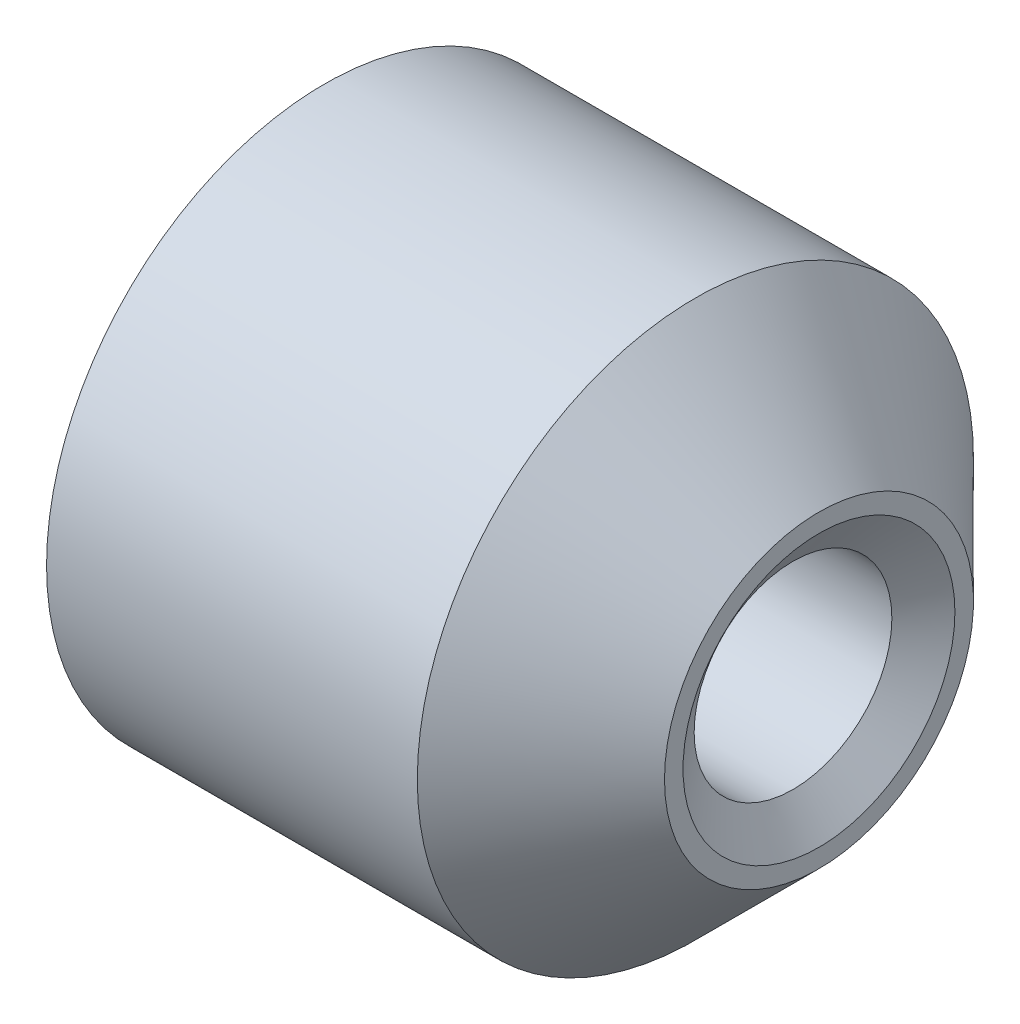
ISO-10303-21;
HEADER;
FILE_DESCRIPTION(('STEP AP214'),'2;1');
FILE_NAME('part.step','',(''),(''),'','','');
FILE_SCHEMA(('AUTOMOTIVE_DESIGN { 1 0 10303 214 1 1 1 1 }'));
ENDSEC;
DATA;
#1=APPLICATION_CONTEXT('core data for automotive mechanical design processes');
#2=APPLICATION_PROTOCOL_DEFINITION('international standard','automotive_design',2000,#1);
#3=PRODUCT_CONTEXT('',#1,'mechanical');
#4=PRODUCT('Part','Part','',(#3));
#5=PRODUCT_RELATED_PRODUCT_CATEGORY('part','',(#4));
#6=PRODUCT_DEFINITION_FORMATION('','',#4);
#7=PRODUCT_DEFINITION_CONTEXT('part definition',#1,'design');
#8=PRODUCT_DEFINITION('design','',#6,#7);
#9=PRODUCT_DEFINITION_SHAPE('','',#8);
#10=(LENGTH_UNIT() NAMED_UNIT(*) SI_UNIT(.MILLI.,.METRE.));
#11=(NAMED_UNIT(*) PLANE_ANGLE_UNIT() SI_UNIT($,.RADIAN.));
#12=(NAMED_UNIT(*) SI_UNIT($,.STERADIAN.) SOLID_ANGLE_UNIT());
#13=UNCERTAINTY_MEASURE_WITH_UNIT(LENGTH_MEASURE(1.E-05),#10,'distance_accuracy_value','');
#14=(GEOMETRIC_REPRESENTATION_CONTEXT(3) GLOBAL_UNCERTAINTY_ASSIGNED_CONTEXT((#13)) GLOBAL_UNIT_ASSIGNED_CONTEXT((#10,
#11,#12)) REPRESENTATION_CONTEXT('',''));
#15=CARTESIAN_POINT('',(0.,0.,0.));
#16=DIRECTION('',(0.,0.,1.));
#17=DIRECTION('',(1.,0.,0.));
#18=AXIS2_PLACEMENT_3D('',#15,#16,#17);
#19=CARTESIAN_POINT('',(4.,1.25,0.));
#20=DIRECTION('',(-1.,0.,0.));
#21=DIRECTION('',(0.,0.,1.));
#22=AXIS2_PLACEMENT_3D('',#19,#20,#21);
#23=PLANE('',#22);
#24=CARTESIAN_POINT('',(4.,0.,0.));
#25=DIRECTION('',(-1.,0.,0.));
#26=DIRECTION('',(0.,0.,1.));
#27=AXIS2_PLACEMENT_3D('',#24,#25,#26);
#28=CIRCLE('',#27,1.25);
#29=CARTESIAN_POINT('',(4.,0.,1.25));
#30=VERTEX_POINT('',#29);
#31=EDGE_CURVE('E10',#30,#30,#28,.T.);
#32=ORIENTED_EDGE('',*,*,#31,.F.);
#33=EDGE_LOOP('',(#32));
#34=FACE_BOUND('',#33,.T.);
#35=CARTESIAN_POINT('',(4.,0.,0.));
#36=DIRECTION('',(1.,0.,0.));
#37=DIRECTION('',(0.,0.,-1.));
#38=AXIS2_PLACEMENT_3D('',#35,#36,#37);
#39=CIRCLE('',#38,1.1);
#40=CARTESIAN_POINT('',(4.,0.,-1.1));
#41=VERTEX_POINT('',#40);
#42=EDGE_CURVE('E51',#41,#41,#39,.T.);
#43=ORIENTED_EDGE('',*,*,#42,.F.);
#44=EDGE_LOOP('',(#43));
#45=FACE_BOUND('',#44,.T.);
#46=ADVANCED_FACE('F29',(#34,#45),#23,.F.);
#47=CARTESIAN_POINT('',(4.,0.,0.));
#48=DIRECTION('',(-1.,0.,0.));
#49=DIRECTION('',(0.,0.,1.));
#50=AXIS2_PLACEMENT_3D('',#47,#48,#49);
#51=CONICAL_SURFACE('',#50,1.25,0.78539816339745);
#52=CARTESIAN_POINT('',(3.,0.,0.));
#53=DIRECTION('',(-1.,0.,0.));
#54=DIRECTION('',(0.,0.,1.));
#55=AXIS2_PLACEMENT_3D('',#52,#53,#54);
#56=CIRCLE('',#55,2.25);
#57=CARTESIAN_POINT('',(3.,0.,2.25));
#58=VERTEX_POINT('',#57);
#59=EDGE_CURVE('E35',#58,#58,#56,.T.);
#60=ORIENTED_EDGE('',*,*,#59,.F.);
#61=EDGE_LOOP('',(#60));
#62=FACE_BOUND('',#61,.T.);
#63=ORIENTED_EDGE('',*,*,#31,.T.);
#64=EDGE_LOOP('',(#63));
#65=FACE_BOUND('',#64,.T.);
#66=ADVANCED_FACE('F76',(#62,#65),#51,.T.);
#67=CARTESIAN_POINT('',(0.,0.,0.));
#68=DIRECTION('',(-1.,0.,0.));
#69=DIRECTION('',(0.,0.,1.));
#70=AXIS2_PLACEMENT_3D('',#67,#68,#69);
#71=CYLINDRICAL_SURFACE('',#70,2.25);
#72=CARTESIAN_POINT('',(0.,0.,0.));
#73=DIRECTION('',(-1.,0.,0.));
#74=DIRECTION('',(0.,0.,1.));
#75=AXIS2_PLACEMENT_3D('',#72,#73,#74);
#76=CIRCLE('',#75,2.25);
#77=CARTESIAN_POINT('',(0.,0.,2.25));
#78=VERTEX_POINT('',#77);
#79=EDGE_CURVE('E39',#78,#78,#76,.T.);
#80=ORIENTED_EDGE('',*,*,#79,.F.);
#81=EDGE_LOOP('',(#80));
#82=FACE_BOUND('',#81,.T.);
#83=ORIENTED_EDGE('',*,*,#59,.T.);
#84=EDGE_LOOP('',(#83));
#85=FACE_BOUND('',#84,.T.);
#86=ADVANCED_FACE('F81',(#82,#85),#71,.T.);
#87=CARTESIAN_POINT('',(0.,0.8,0.));
#88=DIRECTION('',(1.,0.,0.));
#89=DIRECTION('',(0.,0.,-1.));
#90=AXIS2_PLACEMENT_3D('',#87,#88,#89);
#91=PLANE('',#90);
#92=CARTESIAN_POINT('',(0.,0.,0.));
#93=DIRECTION('',(1.,0.,0.));
#94=DIRECTION('',(0.,0.,-1.));
#95=AXIS2_PLACEMENT_3D('',#92,#93,#94);
#96=CIRCLE('',#95,1.1);
#97=CARTESIAN_POINT('',(0.,0.,-1.1));
#98=VERTEX_POINT('',#97);
#99=EDGE_CURVE('E54',#98,#98,#96,.T.);
#100=ORIENTED_EDGE('',*,*,#99,.T.);
#101=EDGE_LOOP('',(#100));
#102=FACE_BOUND('',#101,.T.);
#103=ORIENTED_EDGE('',*,*,#79,.T.);
#104=EDGE_LOOP('',(#103));
#105=FACE_BOUND('',#104,.T.);
#106=ADVANCED_FACE('F58',(#102,#105),#91,.F.);
#107=CARTESIAN_POINT('',(4.,0.,0.));
#108=DIRECTION('',(1.,0.,0.));
#109=DIRECTION('',(0.,0.,-1.));
#110=AXIS2_PLACEMENT_3D('',#107,#108,#109);
#111=CONICAL_SURFACE('',#110,1.1,0.959931088596884);
#112=CARTESIAN_POINT('',(3.78993773853709,0.,0.));
#113=DIRECTION('',(1.,0.,0.));
#114=DIRECTION('',(0.,0.,-1.));
#115=AXIS2_PLACEMENT_3D('',#112,#113,#114);
#116=CIRCLE('',#115,0.799999999999999);
#117=CARTESIAN_POINT('',(3.78993773853709,0.,-0.799999999999999));
#118=VERTEX_POINT('',#117);
#119=EDGE_CURVE('E48',#118,#118,#116,.T.);
#120=ORIENTED_EDGE('',*,*,#119,.F.);
#121=EDGE_LOOP('',(#120));
#122=FACE_BOUND('',#121,.T.);
#123=ORIENTED_EDGE('',*,*,#42,.T.);
#124=EDGE_LOOP('',(#123));
#125=FACE_BOUND('',#124,.T.);
#126=ADVANCED_FACE('F65',(#122,#125),#111,.F.);
#127=CARTESIAN_POINT('',(0.210062261462914,0.,0.));
#128=DIRECTION('',(-1.,0.,0.));
#129=DIRECTION('',(0.,0.,1.));
#130=AXIS2_PLACEMENT_3D('',#127,#128,#129);
#131=CONICAL_SURFACE('',#130,0.799999999999999,0.959931088596878);
#132=ORIENTED_EDGE('',*,*,#99,.F.);
#133=EDGE_LOOP('',(#132));
#134=FACE_BOUND('',#133,.T.);
#135=CARTESIAN_POINT('',(0.210062261462914,0.,0.));
#136=DIRECTION('',(1.,0.,0.));
#137=DIRECTION('',(0.,0.,-1.));
#138=AXIS2_PLACEMENT_3D('',#135,#136,#137);
#139=CIRCLE('',#138,0.799999999999999);
#140=CARTESIAN_POINT('',(0.210062261462914,0.,-0.799999999999999));
#141=VERTEX_POINT('',#140);
#142=EDGE_CURVE('E43',#141,#141,#139,.T.);
#143=ORIENTED_EDGE('',*,*,#142,.T.);
#144=EDGE_LOOP('',(#143));
#145=FACE_BOUND('',#144,.T.);
#146=ADVANCED_FACE('F61',(#134,#145),#131,.F.);
#147=CARTESIAN_POINT('',(0.,0.,0.));
#148=DIRECTION('',(-1.,0.,0.));
#149=DIRECTION('',(0.,0.,1.));
#150=AXIS2_PLACEMENT_3D('',#147,#148,#149);
#151=CYLINDRICAL_SURFACE('',#150,0.8);
#152=ORIENTED_EDGE('',*,*,#119,.T.);
#153=EDGE_LOOP('',(#152));
#154=FACE_BOUND('',#153,.T.);
#155=ORIENTED_EDGE('',*,*,#142,.F.);
#156=EDGE_LOOP('',(#155));
#157=FACE_BOUND('',#156,.T.);
#158=ADVANCED_FACE('F64',(#154,#157),#151,.F.);
#159=CLOSED_SHELL('',(#46,#66,#86,#106,#126,#146,#158));
#160=MANIFOLD_SOLID_BREP('B2',#159);
#161=ADVANCED_BREP_SHAPE_REPRESENTATION('',(#18,#160),#14);
#162=SHAPE_DEFINITION_REPRESENTATION(#9,#161);
ENDSEC;
END-ISO-10303-21;
